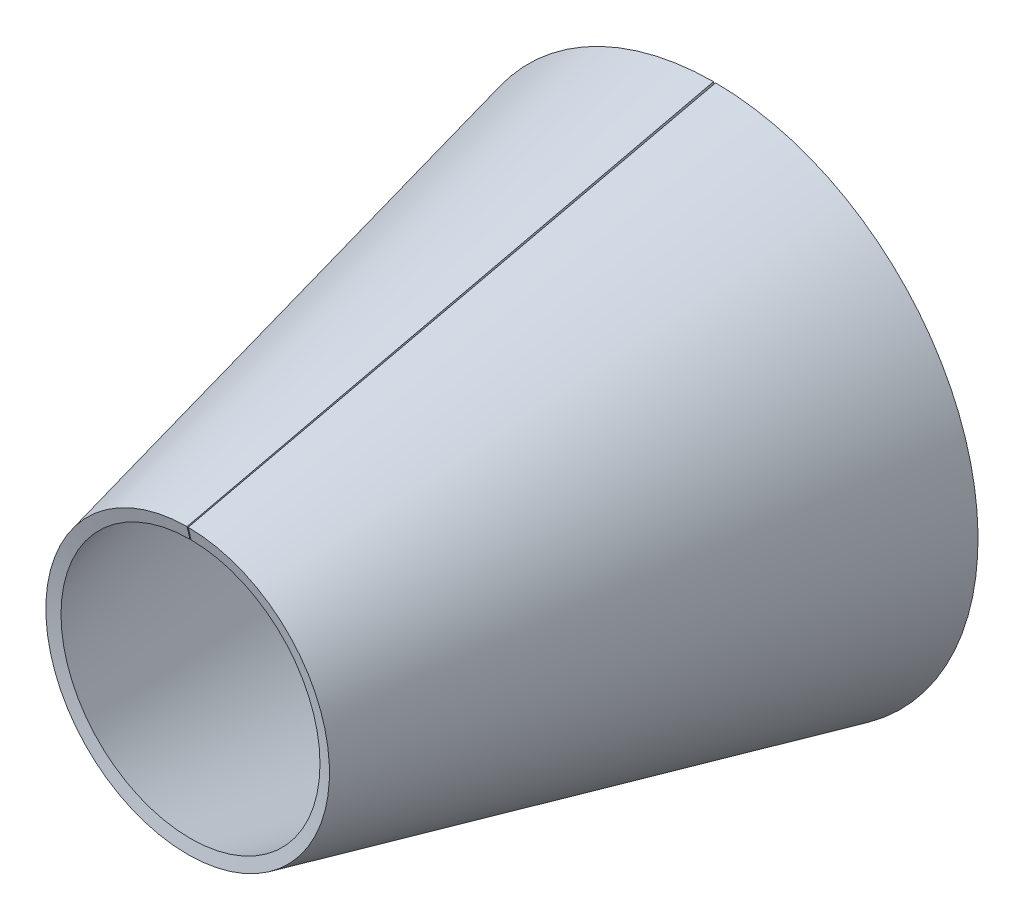
ISO-10303-21;
HEADER;
FILE_DESCRIPTION(('STEP AP214'),'2;1');
FILE_NAME('part.step','',(''),(''),'','','');
FILE_SCHEMA(('AUTOMOTIVE_DESIGN { 1 0 10303 214 1 1 1 1 }'));
ENDSEC;
DATA;
#1=APPLICATION_CONTEXT('core data for automotive mechanical design processes');
#2=APPLICATION_PROTOCOL_DEFINITION('international standard','automotive_design',2000,#1);
#3=PRODUCT_CONTEXT('',#1,'mechanical');
#4=PRODUCT('Part','Part','',(#3));
#5=PRODUCT_RELATED_PRODUCT_CATEGORY('part','',(#4));
#6=PRODUCT_DEFINITION_FORMATION('','',#4);
#7=PRODUCT_DEFINITION_CONTEXT('part definition',#1,'design');
#8=PRODUCT_DEFINITION('design','',#6,#7);
#9=PRODUCT_DEFINITION_SHAPE('','',#8);
#10=(LENGTH_UNIT() NAMED_UNIT(*) SI_UNIT(.MILLI.,.METRE.));
#11=(NAMED_UNIT(*) PLANE_ANGLE_UNIT() SI_UNIT($,.RADIAN.));
#12=(NAMED_UNIT(*) SI_UNIT($,.STERADIAN.) SOLID_ANGLE_UNIT());
#13=UNCERTAINTY_MEASURE_WITH_UNIT(LENGTH_MEASURE(1.E-05),#10,'distance_accuracy_value','');
#14=(GEOMETRIC_REPRESENTATION_CONTEXT(3) GLOBAL_UNCERTAINTY_ASSIGNED_CONTEXT((#13)) GLOBAL_UNIT_ASSIGNED_CONTEXT((#10,
#11,#12)) REPRESENTATION_CONTEXT('',''));
#15=CARTESIAN_POINT('',(0.,0.,0.));
#16=DIRECTION('',(0.,0.,1.));
#17=DIRECTION('',(1.,0.,0.));
#18=AXIS2_PLACEMENT_3D('',#15,#16,#17);
#19=CARTESIAN_POINT('',(0.,0.,-0.226264768501183));
#20=DIRECTION('',(0.,0.,1.));
#21=DIRECTION('',(1.,0.,0.));
#22=AXIS2_PLACEMENT_3D('',#19,#20,#21);
#23=CONICAL_SURFACE('',#22,30.7699396140364,1.34390352403563);
#24=DIRECTION('',(-0.00389748025912706,-0.974362269793537,-0.224951054343866));
#25=VECTOR('',#24,1.);
#26=CARTESIAN_POINT('',(0.123079758455707,30.7696934535349,-0.226264768501183));
#27=LINE('',#26,#25);
#28=CARTESIAN_POINT('',(0.126999999999618,31.749745998984,0.));
#29=VERTEX_POINT('',#28);
#30=CARTESIAN_POINT('',(0.121060240084705,30.2648178998186,-0.342825406819958));
#31=VERTEX_POINT('',#30);
#32=EDGE_CURVE('E11',#29,#31,#27,.T.);
#33=ORIENTED_EDGE('',*,*,#32,.F.);
#34=CARTESIAN_POINT('',(0.,0.,0.));
#35=DIRECTION('',(0.,0.,-1.));
#36=DIRECTION('',(-1.,0.,0.));
#37=AXIS2_PLACEMENT_3D('',#34,#35,#36);
#38=CIRCLE('',#37,31.75);
#39=CARTESIAN_POINT('',(-0.12700000000001,31.749745998984,0.));
#40=VERTEX_POINT('',#39);
#41=EDGE_CURVE('E79',#29,#40,#38,.T.);
#42=ORIENTED_EDGE('',*,*,#41,.T.);
#43=DIRECTION('',(0.00389748025914103,-0.974362269793537,-0.224951054343866));
#44=VECTOR('',#43,1.);
#45=CARTESIAN_POINT('',(-0.123079758456148,30.7696934535349,-0.226264768501211));
#46=LINE('',#45,#44);
#47=CARTESIAN_POINT('',(-0.121060240085078,30.2648178998186,-0.342825406819958));
#48=VERTEX_POINT('',#47);
#49=EDGE_CURVE('E51',#40,#48,#46,.T.);
#50=ORIENTED_EDGE('',*,*,#49,.T.);
#51=CARTESIAN_POINT('',(0.,0.,-0.342825406819958));
#52=DIRECTION('',(0.,0.,-1.));
#53=DIRECTION('',(-1.,0.,0.));
#54=AXIS2_PLACEMENT_3D('',#51,#52,#53);
#55=CIRCLE('',#54,30.2650600212673);
#56=EDGE_CURVE('E81',#31,#48,#55,.T.);
#57=ORIENTED_EDGE('',*,*,#56,.F.);
#58=EDGE_LOOP('',(#33,#42,#50,#57));
#59=FACE_BOUND('',#58,.T.);
#60=ADVANCED_FACE('F41',(#59),#23,.T.);
#61=CARTESIAN_POINT('',(-0.123079758456153,30.7696934535349,-0.226264768501211));
#62=DIRECTION('',(-0.999991999968,-0.00400000000000021,0.));
#63=DIRECTION('',(0.000899804217375509,-0.224949254728232,0.974370064785235));
#64=AXIS2_PLACEMENT_3D('',#61,#62,#63);
#65=PLANE('',#64);
#66=ORIENTED_EDGE('',*,*,#49,.F.);
#67=DIRECTION('',(-0.000899804217375531,0.224949254728232,-0.974370064785235));
#68=VECTOR('',#67,1.);
#69=CARTESIAN_POINT('',(-0.76790988991463,191.975936652719,-694.021431438767));
#70=LINE('',#69,#68);
#71=CARTESIAN_POINT('',(-0.068359479454112,17.0897331440209,63.5));
#72=VERTEX_POINT('',#71);
#73=EDGE_CURVE('E93',#40,#72,#70,.F.);
#74=ORIENTED_EDGE('',*,*,#73,.T.);
#75=DIRECTION('',(0.00389748025914118,-0.974362269793537,-0.224951054343866));
#76=VECTOR('',#75,1.);
#77=CARTESIAN_POINT('',(-0.0644392379102565,16.1096805985718,63.2737352314988));
#78=LINE('',#77,#76);
#79=CARTESIAN_POINT('',(-0.0624197195391807,15.6048050448555,63.15717459318));
#80=VERTEX_POINT('',#79);
#81=EDGE_CURVE('E102',#72,#80,#78,.T.);
#82=ORIENTED_EDGE('',*,*,#81,.T.);
#83=DIRECTION('',(-0.000899804217375531,0.224949254728232,-0.974370064785235));
#84=VECTOR('',#83,1.);
#85=CARTESIAN_POINT('',(-0.761970129999698,190.491008553554,-694.364256845587));
#86=LINE('',#85,#84);
#87=EDGE_CURVE('E97',#48,#80,#86,.F.);
#88=ORIENTED_EDGE('',*,*,#87,.F.);
#89=EDGE_LOOP('',(#66,#74,#82,#88));
#90=FACE_BOUND('',#89,.T.);
#91=ADVANCED_FACE('F110',(#90),#65,.F.);
#92=CARTESIAN_POINT('',(0.,0.,63.2737352314988));
#93=DIRECTION('',(0.,0.,1.));
#94=DIRECTION('',(1.,0.,0.));
#95=AXIS2_PLACEMENT_3D('',#92,#93,#94);
#96=CONICAL_SURFACE('',#95,16.1098094775631,1.34390352403563);
#97=ORIENTED_EDGE('',*,*,#81,.F.);
#98=CARTESIAN_POINT('',(0.,0.,63.5));
#99=DIRECTION('',(0.,0.,-1.));
#100=DIRECTION('',(-1.,0.,0.));
#101=AXIS2_PLACEMENT_3D('',#98,#99,#100);
#102=CIRCLE('',#101,17.0898698635267);
#103=CARTESIAN_POINT('',(0.0683594794539013,17.0897331440209,63.5));
#104=VERTEX_POINT('',#103);
#105=EDGE_CURVE('E95',#72,#104,#102,.F.);
#106=ORIENTED_EDGE('',*,*,#105,.T.);
#107=DIRECTION('',(-0.00389748025913324,-0.974362269793537,-0.224951054343866));
#108=VECTOR('',#107,1.);
#109=CARTESIAN_POINT('',(0.0644392379101252,16.1096805985718,63.2737352314988));
#110=LINE('',#109,#108);
#111=CARTESIAN_POINT('',(0.0624197195389884,15.6048050448555,63.15717459318));
#112=VERTEX_POINT('',#111);
#113=EDGE_CURVE('E45',#104,#112,#110,.T.);
#114=ORIENTED_EDGE('',*,*,#113,.T.);
#115=CARTESIAN_POINT('',(0.,0.,63.15717459318));
#116=DIRECTION('',(0.,0.,-1.));
#117=DIRECTION('',(-1.,0.,0.));
#118=AXIS2_PLACEMENT_3D('',#115,#116,#117);
#119=CIRCLE('',#118,15.604929884794);
#120=EDGE_CURVE('E111',#80,#112,#119,.F.);
#121=ORIENTED_EDGE('',*,*,#120,.F.);
#122=EDGE_LOOP('',(#97,#106,#114,#121));
#123=FACE_BOUND('',#122,.T.);
#124=ADVANCED_FACE('F115',(#123),#96,.F.);
#125=CARTESIAN_POINT('',(0.0644392379101246,16.1096805985718,63.2737352314988));
#126=DIRECTION('',(0.999991999968,-0.00399999999997905,0.));
#127=DIRECTION('',(0.000899804217370749,0.224949254728232,-0.974370064785235));
#128=AXIS2_PLACEMENT_3D('',#125,#126,#127);
#129=PLANE('',#128);
#130=DIRECTION('',(0.000899804217372757,0.224949254728232,-0.974370064785235));
#131=VECTOR('',#130,1.);
#132=CARTESIAN_POINT('',(0.767909889912262,191.975936652719,-694.021431438767));
#133=LINE('',#132,#131);
#134=EDGE_CURVE('E91',#104,#29,#133,.T.);
#135=ORIENTED_EDGE('',*,*,#134,.T.);
#136=ORIENTED_EDGE('',*,*,#32,.T.);
#137=DIRECTION('',(0.000899804217372757,0.224949254728232,-0.974370064785235));
#138=VECTOR('',#137,1.);
#139=CARTESIAN_POINT('',(0.761970129997349,190.491008553554,-694.364256845587));
#140=LINE('',#139,#138);
#141=EDGE_CURVE('E109',#112,#31,#140,.T.);
#142=ORIENTED_EDGE('',*,*,#141,.F.);
#143=ORIENTED_EDGE('',*,*,#113,.F.);
#144=EDGE_LOOP('',(#135,#136,#142,#143));
#145=FACE_BOUND('',#144,.T.);
#146=ADVANCED_FACE('F43',(#145),#129,.F.);
#147=CARTESIAN_POINT('',(0.,0.,-694.364256845587));
#148=DIRECTION('',(0.,0.,-1.));
#149=DIRECTION('',(-1.,0.,0.));
#150=AXIS2_PLACEMENT_3D('',#147,#148,#149);
#151=CONICAL_SURFACE('',#150,190.49253249991,0.226892802759263);
#152=ORIENTED_EDGE('',*,*,#120,.T.);
#153=ORIENTED_EDGE('',*,*,#141,.T.);
#154=ORIENTED_EDGE('',*,*,#56,.T.);
#155=ORIENTED_EDGE('',*,*,#87,.T.);
#156=EDGE_LOOP('',(#152,#153,#154,#155));
#157=FACE_BOUND('',#156,.T.);
#158=ADVANCED_FACE('F108',(#157),#151,.F.);
#159=CARTESIAN_POINT('',(0.,0.,-694.021431438767));
#160=DIRECTION('',(0.,0.,-1.));
#161=DIRECTION('',(-1.,0.,0.));
#162=AXIS2_PLACEMENT_3D('',#159,#160,#161);
#163=CONICAL_SURFACE('',#162,191.977472478643,0.226892802759263);
#164=ORIENTED_EDGE('',*,*,#105,.F.);
#165=ORIENTED_EDGE('',*,*,#73,.F.);
#166=ORIENTED_EDGE('',*,*,#41,.F.);
#167=ORIENTED_EDGE('',*,*,#134,.F.);
#168=EDGE_LOOP('',(#164,#165,#166,#167));
#169=FACE_BOUND('',#168,.T.);
#170=ADVANCED_FACE('F90',(#169),#163,.T.);
#171=CLOSED_SHELL('',(#60,#91,#124,#146,#158,#170));
#172=MANIFOLD_SOLID_BREP('B2',#171);
#173=ADVANCED_BREP_SHAPE_REPRESENTATION('',(#18,#172),#14);
#174=SHAPE_DEFINITION_REPRESENTATION(#9,#173);
ENDSEC;
END-ISO-10303-21;
